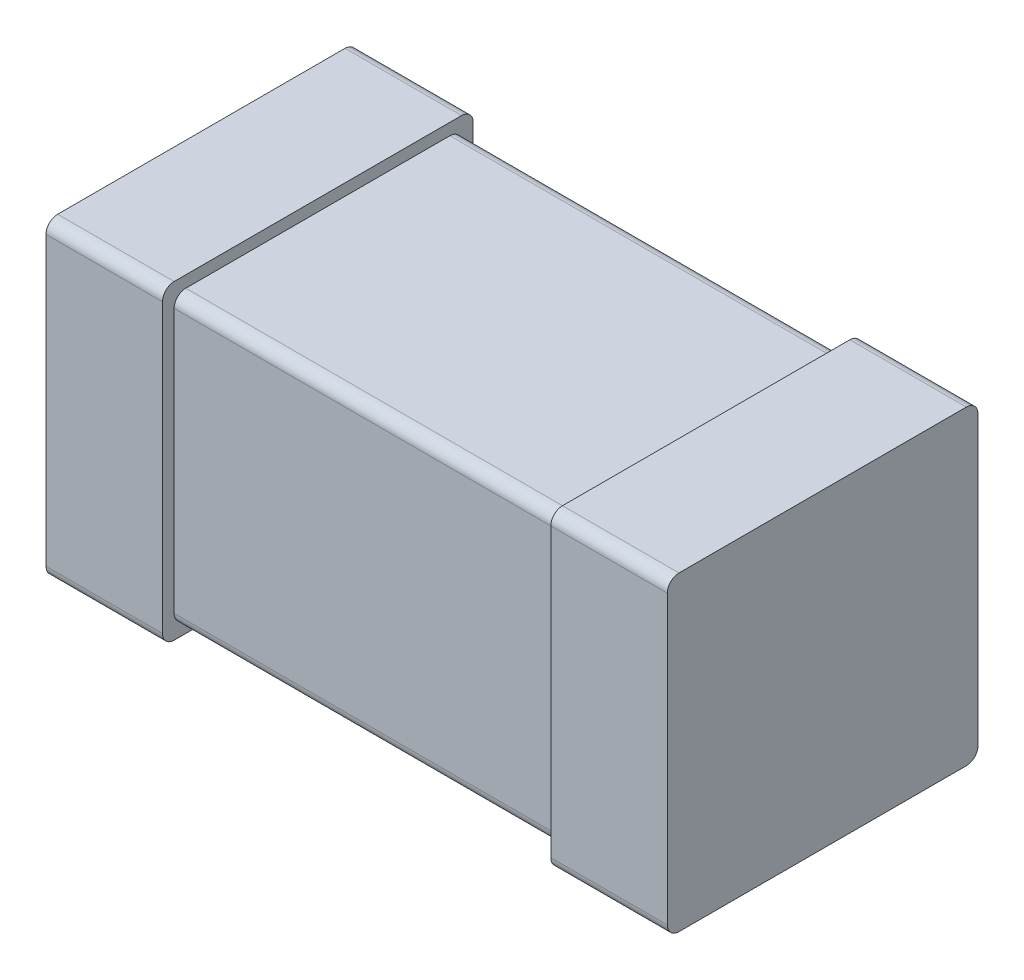
ISO-10303-21;
HEADER;
FILE_DESCRIPTION(('STEP AP214'),'2;1');
FILE_NAME('part.step','',(''),(''),'','','');
FILE_SCHEMA(('AUTOMOTIVE_DESIGN { 1 0 10303 214 1 1 1 1 }'));
ENDSEC;
DATA;
#1=APPLICATION_CONTEXT('core data for automotive mechanical design processes');
#2=APPLICATION_PROTOCOL_DEFINITION('international standard','automotive_design',2000,#1);
#3=PRODUCT_CONTEXT('',#1,'mechanical');
#4=PRODUCT('Part','Part','',(#3));
#5=PRODUCT_RELATED_PRODUCT_CATEGORY('part','',(#4));
#6=PRODUCT_DEFINITION_FORMATION('','',#4);
#7=PRODUCT_DEFINITION_CONTEXT('part definition',#1,'design');
#8=PRODUCT_DEFINITION('design','',#6,#7);
#9=PRODUCT_DEFINITION_SHAPE('','',#8);
#10=(LENGTH_UNIT() NAMED_UNIT(*) SI_UNIT(.MILLI.,.METRE.));
#11=(NAMED_UNIT(*) PLANE_ANGLE_UNIT() SI_UNIT($,.RADIAN.));
#12=(NAMED_UNIT(*) SI_UNIT($,.STERADIAN.) SOLID_ANGLE_UNIT());
#13=UNCERTAINTY_MEASURE_WITH_UNIT(LENGTH_MEASURE(1.E-05),#10,'distance_accuracy_value','');
#14=(GEOMETRIC_REPRESENTATION_CONTEXT(3) GLOBAL_UNCERTAINTY_ASSIGNED_CONTEXT((#13)) GLOBAL_UNIT_ASSIGNED_CONTEXT((#10,
#11,#12)) REPRESENTATION_CONTEXT('',''));
#15=CARTESIAN_POINT('',(0.,0.,0.));
#16=DIRECTION('',(0.,0.,1.));
#17=DIRECTION('',(1.,0.,0.));
#18=AXIS2_PLACEMENT_3D('',#15,#16,#17);
#19=CARTESIAN_POINT('',(0.8,-0.4,0.));
#20=DIRECTION('',(1.,0.,0.));
#21=DIRECTION('',(0.,1.,0.));
#22=AXIS2_PLACEMENT_3D('',#19,#20,#21);
#23=PLANE('',#22);
#24=DIRECTION('',(0.,0.,1.));
#25=VECTOR('',#24,1.);
#26=CARTESIAN_POINT('',(0.8,-0.4,0.));
#27=LINE('',#26,#25);
#28=CARTESIAN_POINT('',(0.8,-0.4,0.03));
#29=VERTEX_POINT('',#28);
#30=CARTESIAN_POINT('',(0.8,-0.4,0.77));
#31=VERTEX_POINT('',#30);
#32=EDGE_CURVE('E305',#29,#31,#27,.T.);
#33=ORIENTED_EDGE('',*,*,#32,.F.);
#34=CARTESIAN_POINT('',(0.8,-0.37,0.03));
#35=DIRECTION('',(1.,0.,0.));
#36=DIRECTION('',(0.,0.,1.));
#37=AXIS2_PLACEMENT_3D('',#34,#35,#36);
#38=CIRCLE('',#37,0.03);
#39=CARTESIAN_POINT('',(0.8,-0.37,0.));
#40=VERTEX_POINT('',#39);
#41=EDGE_CURVE('E304',#29,#40,#38,.T.);
#42=ORIENTED_EDGE('',*,*,#41,.T.);
#43=DIRECTION('',(0.,1.,0.));
#44=VECTOR('',#43,1.);
#45=CARTESIAN_POINT('',(0.8,-0.4,0.));
#46=LINE('',#45,#44);
#47=CARTESIAN_POINT('',(0.8,0.37,0.));
#48=VERTEX_POINT('',#47);
#49=EDGE_CURVE('E276',#40,#48,#46,.T.);
#50=ORIENTED_EDGE('',*,*,#49,.T.);
#51=CARTESIAN_POINT('',(0.8,0.37,0.03));
#52=DIRECTION('',(-1.,0.,0.));
#53=DIRECTION('',(0.,0.,1.));
#54=AXIS2_PLACEMENT_3D('',#51,#52,#53);
#55=CIRCLE('',#54,0.03);
#56=CARTESIAN_POINT('',(0.8,0.4,0.03));
#57=VERTEX_POINT('',#56);
#58=EDGE_CURVE('E506',#57,#48,#55,.T.);
#59=ORIENTED_EDGE('',*,*,#58,.F.);
#60=DIRECTION('',(0.,0.,1.));
#61=VECTOR('',#60,1.);
#62=CARTESIAN_POINT('',(0.8,0.4,0.));
#63=LINE('',#62,#61);
#64=CARTESIAN_POINT('',(0.8,0.4,0.77));
#65=VERTEX_POINT('',#64);
#66=EDGE_CURVE('E11',#57,#65,#63,.T.);
#67=ORIENTED_EDGE('',*,*,#66,.T.);
#68=CARTESIAN_POINT('',(0.8,0.37,0.77));
#69=DIRECTION('',(1.,0.,0.));
#70=DIRECTION('',(0.,0.,1.));
#71=AXIS2_PLACEMENT_3D('',#68,#69,#70);
#72=CIRCLE('',#71,0.03);
#73=CARTESIAN_POINT('',(0.8,0.37,0.8));
#74=VERTEX_POINT('',#73);
#75=EDGE_CURVE('E20',#65,#74,#72,.T.);
#76=ORIENTED_EDGE('',*,*,#75,.T.);
#77=DIRECTION('',(0.,1.,0.));
#78=VECTOR('',#77,1.);
#79=CARTESIAN_POINT('',(0.8,-0.4,0.8));
#80=LINE('',#79,#78);
#81=CARTESIAN_POINT('',(0.8,-0.37,0.8));
#82=VERTEX_POINT('',#81);
#83=EDGE_CURVE('E280',#82,#74,#80,.T.);
#84=ORIENTED_EDGE('',*,*,#83,.F.);
#85=CARTESIAN_POINT('',(0.8,-0.37,0.77));
#86=DIRECTION('',(-1.,0.,0.));
#87=DIRECTION('',(0.,0.,1.));
#88=AXIS2_PLACEMENT_3D('',#85,#86,#87);
#89=CIRCLE('',#88,0.03);
#90=EDGE_CURVE('E333',#31,#82,#89,.T.);
#91=ORIENTED_EDGE('',*,*,#90,.F.);
#92=EDGE_LOOP('',(#33,#42,#50,#59,#67,#76,#84,#91));
#93=FACE_BOUND('',#92,.T.);
#94=ADVANCED_FACE('F17',(#93),#23,.T.);
#95=CARTESIAN_POINT('',(0.5,0.4,0.));
#96=DIRECTION('',(0.,1.,0.));
#97=DIRECTION('',(1.,0.,0.));
#98=AXIS2_PLACEMENT_3D('',#95,#96,#97);
#99=PLANE('',#98);
#100=ORIENTED_EDGE('',*,*,#66,.F.);
#101=DIRECTION('',(1.,0.,0.));
#102=VECTOR('',#101,1.);
#103=CARTESIAN_POINT('',(0.5,0.4,0.03));
#104=LINE('',#103,#102);
#105=CARTESIAN_POINT('',(0.5,0.4,0.03));
#106=VERTEX_POINT('',#105);
#107=EDGE_CURVE('E503',#106,#57,#104,.T.);
#108=ORIENTED_EDGE('',*,*,#107,.F.);
#109=DIRECTION('',(0.,0.,1.));
#110=VECTOR('',#109,1.);
#111=CARTESIAN_POINT('',(0.5,0.4,0.));
#112=LINE('',#111,#110);
#113=CARTESIAN_POINT('',(0.5,0.4,0.77));
#114=VERTEX_POINT('',#113);
#115=EDGE_CURVE('E372',#106,#114,#112,.T.);
#116=ORIENTED_EDGE('',*,*,#115,.T.);
#117=DIRECTION('',(1.,0.,0.));
#118=VECTOR('',#117,1.);
#119=CARTESIAN_POINT('',(0.5,0.4,0.77));
#120=LINE('',#119,#118);
#121=EDGE_CURVE('E26',#114,#65,#120,.T.);
#122=ORIENTED_EDGE('',*,*,#121,.T.);
#123=EDGE_LOOP('',(#100,#108,#116,#122));
#124=FACE_BOUND('',#123,.T.);
#125=ADVANCED_FACE('F538',(#124),#99,.T.);
#126=CARTESIAN_POINT('',(0.5,0.37,0.77));
#127=DIRECTION('',(1.,0.,0.));
#128=DIRECTION('',(0.,1.,0.));
#129=AXIS2_PLACEMENT_3D('',#126,#127,#128);
#130=CYLINDRICAL_SURFACE('',#129,0.03);
#131=CARTESIAN_POINT('',(0.5,0.37,0.77));
#132=DIRECTION('',(1.,0.,0.));
#133=DIRECTION('',(0.,0.,1.));
#134=AXIS2_PLACEMENT_3D('',#131,#132,#133);
#135=CIRCLE('',#134,0.03);
#136=CARTESIAN_POINT('',(0.5,0.37,0.8));
#137=VERTEX_POINT('',#136);
#138=EDGE_CURVE('E377',#114,#137,#135,.T.);
#139=ORIENTED_EDGE('',*,*,#138,.T.);
#140=DIRECTION('',(1.,0.,0.));
#141=VECTOR('',#140,1.);
#142=CARTESIAN_POINT('',(0.5,0.37,0.8));
#143=LINE('',#142,#141);
#144=EDGE_CURVE('E497',#137,#74,#143,.T.);
#145=ORIENTED_EDGE('',*,*,#144,.T.);
#146=ORIENTED_EDGE('',*,*,#75,.F.);
#147=ORIENTED_EDGE('',*,*,#121,.F.);
#148=EDGE_LOOP('',(#139,#145,#146,#147));
#149=FACE_BOUND('',#148,.T.);
#150=ADVANCED_FACE('F516',(#149),#130,.T.);
#151=CARTESIAN_POINT('',(0.5,0.37,0.03));
#152=DIRECTION('',(1.,0.,0.));
#153=DIRECTION('',(0.,1.,0.));
#154=AXIS2_PLACEMENT_3D('',#151,#152,#153);
#155=CYLINDRICAL_SURFACE('',#154,0.03);
#156=ORIENTED_EDGE('',*,*,#107,.T.);
#157=ORIENTED_EDGE('',*,*,#58,.T.);
#158=DIRECTION('',(1.,0.,0.));
#159=VECTOR('',#158,1.);
#160=CARTESIAN_POINT('',(0.5,0.37,0.));
#161=LINE('',#160,#159);
#162=CARTESIAN_POINT('',(0.5,0.37,0.));
#163=VERTEX_POINT('',#162);
#164=EDGE_CURVE('E281',#163,#48,#161,.T.);
#165=ORIENTED_EDGE('',*,*,#164,.F.);
#166=CARTESIAN_POINT('',(0.5,0.37,0.03));
#167=DIRECTION('',(-1.,0.,0.));
#168=DIRECTION('',(0.,0.,1.));
#169=AXIS2_PLACEMENT_3D('',#166,#167,#168);
#170=CIRCLE('',#169,0.03);
#171=EDGE_CURVE('E376',#106,#163,#170,.T.);
#172=ORIENTED_EDGE('',*,*,#171,.F.);
#173=EDGE_LOOP('',(#156,#157,#165,#172));
#174=FACE_BOUND('',#173,.T.);
#175=ADVANCED_FACE('F534',(#174),#155,.T.);
#176=CARTESIAN_POINT('',(0.5,-0.4,0.8));
#177=DIRECTION('',(0.,0.,1.));
#178=DIRECTION('',(1.,0.,0.));
#179=AXIS2_PLACEMENT_3D('',#176,#177,#178);
#180=PLANE('',#179);
#181=DIRECTION('',(0.,1.,0.));
#182=VECTOR('',#181,1.);
#183=CARTESIAN_POINT('',(0.5,-0.4,0.8));
#184=LINE('',#183,#182);
#185=CARTESIAN_POINT('',(0.5,-0.37,0.8));
#186=VERTEX_POINT('',#185);
#187=EDGE_CURVE('E468',#186,#137,#184,.T.);
#188=ORIENTED_EDGE('',*,*,#187,.F.);
#189=DIRECTION('',(1.,0.,0.));
#190=VECTOR('',#189,1.);
#191=CARTESIAN_POINT('',(0.5,-0.37,0.8));
#192=LINE('',#191,#190);
#193=EDGE_CURVE('E393',#186,#82,#192,.T.);
#194=ORIENTED_EDGE('',*,*,#193,.T.);
#195=ORIENTED_EDGE('',*,*,#83,.T.);
#196=ORIENTED_EDGE('',*,*,#144,.F.);
#197=EDGE_LOOP('',(#188,#194,#195,#196));
#198=FACE_BOUND('',#197,.T.);
#199=ADVANCED_FACE('F520',(#198),#180,.T.);
#200=CARTESIAN_POINT('',(0.5,-0.4,0.));
#201=DIRECTION('',(0.,0.,1.));
#202=DIRECTION('',(1.,0.,0.));
#203=AXIS2_PLACEMENT_3D('',#200,#201,#202);
#204=PLANE('',#203);
#205=ORIENTED_EDGE('',*,*,#164,.T.);
#206=ORIENTED_EDGE('',*,*,#49,.F.);
#207=DIRECTION('',(1.,0.,0.));
#208=VECTOR('',#207,1.);
#209=CARTESIAN_POINT('',(0.5,-0.37,0.));
#210=LINE('',#209,#208);
#211=CARTESIAN_POINT('',(0.5,-0.37,0.));
#212=VERTEX_POINT('',#211);
#213=EDGE_CURVE('E300',#212,#40,#210,.T.);
#214=ORIENTED_EDGE('',*,*,#213,.F.);
#215=DIRECTION('',(0.,1.,0.));
#216=VECTOR('',#215,1.);
#217=CARTESIAN_POINT('',(0.5,-0.4,0.));
#218=LINE('',#217,#216);
#219=EDGE_CURVE('E478',#212,#163,#218,.T.);
#220=ORIENTED_EDGE('',*,*,#219,.T.);
#221=EDGE_LOOP('',(#205,#206,#214,#220));
#222=FACE_BOUND('',#221,.T.);
#223=ADVANCED_FACE('F532',(#222),#204,.F.);
#224=CARTESIAN_POINT('',(0.5,-0.37,0.77));
#225=DIRECTION('',(1.,0.,0.));
#226=DIRECTION('',(0.,-1.,0.));
#227=AXIS2_PLACEMENT_3D('',#224,#225,#226);
#228=CYLINDRICAL_SURFACE('',#227,0.03);
#229=DIRECTION('',(1.,0.,0.));
#230=VECTOR('',#229,1.);
#231=CARTESIAN_POINT('',(0.5,-0.4,0.77));
#232=LINE('',#231,#230);
#233=CARTESIAN_POINT('',(0.5,-0.4,0.77));
#234=VERTEX_POINT('',#233);
#235=EDGE_CURVE('E286',#234,#31,#232,.T.);
#236=ORIENTED_EDGE('',*,*,#235,.T.);
#237=ORIENTED_EDGE('',*,*,#90,.T.);
#238=ORIENTED_EDGE('',*,*,#193,.F.);
#239=CARTESIAN_POINT('',(0.5,-0.37,0.77));
#240=DIRECTION('',(-1.,0.,0.));
#241=DIRECTION('',(0.,0.,1.));
#242=AXIS2_PLACEMENT_3D('',#239,#240,#241);
#243=CIRCLE('',#242,0.03);
#244=EDGE_CURVE('E464',#234,#186,#243,.T.);
#245=ORIENTED_EDGE('',*,*,#244,.F.);
#246=EDGE_LOOP('',(#236,#237,#238,#245));
#247=FACE_BOUND('',#246,.T.);
#248=ADVANCED_FACE('F523',(#247),#228,.T.);
#249=CARTESIAN_POINT('',(0.5,-0.37,0.03));
#250=DIRECTION('',(1.,0.,0.));
#251=DIRECTION('',(0.,-1.,0.));
#252=AXIS2_PLACEMENT_3D('',#249,#250,#251);
#253=CYLINDRICAL_SURFACE('',#252,0.03);
#254=CARTESIAN_POINT('',(0.5,-0.37,0.03));
#255=DIRECTION('',(1.,0.,0.));
#256=DIRECTION('',(0.,0.,1.));
#257=AXIS2_PLACEMENT_3D('',#254,#255,#256);
#258=CIRCLE('',#257,0.03);
#259=CARTESIAN_POINT('',(0.5,-0.4,0.03));
#260=VERTEX_POINT('',#259);
#261=EDGE_CURVE('E287',#260,#212,#258,.T.);
#262=ORIENTED_EDGE('',*,*,#261,.T.);
#263=ORIENTED_EDGE('',*,*,#213,.T.);
#264=ORIENTED_EDGE('',*,*,#41,.F.);
#265=DIRECTION('',(1.,0.,0.));
#266=VECTOR('',#265,1.);
#267=CARTESIAN_POINT('',(0.5,-0.4,0.03));
#268=LINE('',#267,#266);
#269=EDGE_CURVE('E445',#260,#29,#268,.T.);
#270=ORIENTED_EDGE('',*,*,#269,.F.);
#271=EDGE_LOOP('',(#262,#263,#264,#270));
#272=FACE_BOUND('',#271,.T.);
#273=ADVANCED_FACE('F529',(#272),#253,.T.);
#274=CARTESIAN_POINT('',(0.5,-0.4,0.));
#275=DIRECTION('',(0.,1.,0.));
#276=DIRECTION('',(1.,0.,0.));
#277=AXIS2_PLACEMENT_3D('',#274,#275,#276);
#278=PLANE('',#277);
#279=ORIENTED_EDGE('',*,*,#235,.F.);
#280=DIRECTION('',(0.,0.,1.));
#281=VECTOR('',#280,1.);
#282=CARTESIAN_POINT('',(0.5,-0.4,0.));
#283=LINE('',#282,#281);
#284=EDGE_CURVE('E282',#260,#234,#283,.T.);
#285=ORIENTED_EDGE('',*,*,#284,.F.);
#286=ORIENTED_EDGE('',*,*,#269,.T.);
#287=ORIENTED_EDGE('',*,*,#32,.T.);
#288=EDGE_LOOP('',(#279,#285,#286,#287));
#289=FACE_BOUND('',#288,.T.);
#290=ADVANCED_FACE('F525',(#289),#278,.F.);
#291=CARTESIAN_POINT('',(0.5,-0.4,0.));
#292=DIRECTION('',(1.,0.,0.));
#293=DIRECTION('',(0.,1.,0.));
#294=AXIS2_PLACEMENT_3D('',#291,#292,#293);
#295=PLANE('',#294);
#296=DIRECTION('',(0.,1.,0.));
#297=VECTOR('',#296,1.);
#298=CARTESIAN_POINT('',(0.5,-0.37,0.03));
#299=LINE('',#298,#297);
#300=CARTESIAN_POINT('',(0.5,-0.34,0.03));
#301=VERTEX_POINT('',#300);
#302=CARTESIAN_POINT('',(0.5,0.34,0.03));
#303=VERTEX_POINT('',#302);
#304=EDGE_CURVE('E310',#301,#303,#299,.T.);
#305=ORIENTED_EDGE('',*,*,#304,.T.);
#306=CARTESIAN_POINT('',(0.5,0.34,0.06));
#307=DIRECTION('',(-1.,0.,0.));
#308=DIRECTION('',(0.,0.,1.));
#309=AXIS2_PLACEMENT_3D('',#306,#307,#308);
#310=CIRCLE('',#309,0.03);
#311=CARTESIAN_POINT('',(0.5,0.37,0.06));
#312=VERTEX_POINT('',#311);
#313=EDGE_CURVE('E407',#312,#303,#310,.T.);
#314=ORIENTED_EDGE('',*,*,#313,.F.);
#315=DIRECTION('',(0.,0.,1.));
#316=VECTOR('',#315,1.);
#317=CARTESIAN_POINT('',(0.5,0.37,0.03));
#318=LINE('',#317,#316);
#319=CARTESIAN_POINT('',(0.5,0.37,0.74));
#320=VERTEX_POINT('',#319);
#321=EDGE_CURVE('E402',#312,#320,#318,.T.);
#322=ORIENTED_EDGE('',*,*,#321,.T.);
#323=CARTESIAN_POINT('',(0.5,0.34,0.74));
#324=DIRECTION('',(1.,0.,0.));
#325=DIRECTION('',(0.,0.,1.));
#326=AXIS2_PLACEMENT_3D('',#323,#324,#325);
#327=CIRCLE('',#326,0.03);
#328=CARTESIAN_POINT('',(0.5,0.34,0.77));
#329=VERTEX_POINT('',#328);
#330=EDGE_CURVE('E353',#320,#329,#327,.T.);
#331=ORIENTED_EDGE('',*,*,#330,.T.);
#332=DIRECTION('',(0.,1.,0.));
#333=VECTOR('',#332,1.);
#334=CARTESIAN_POINT('',(0.5,-0.37,0.77));
#335=LINE('',#334,#333);
#336=CARTESIAN_POINT('',(0.5,-0.34,0.77));
#337=VERTEX_POINT('',#336);
#338=EDGE_CURVE('E352',#337,#329,#335,.T.);
#339=ORIENTED_EDGE('',*,*,#338,.F.);
#340=CARTESIAN_POINT('',(0.5,-0.34,0.74));
#341=DIRECTION('',(-1.,0.,0.));
#342=DIRECTION('',(0.,0.,1.));
#343=AXIS2_PLACEMENT_3D('',#340,#341,#342);
#344=CIRCLE('',#343,0.03);
#345=CARTESIAN_POINT('',(0.5,-0.37,0.74));
#346=VERTEX_POINT('',#345);
#347=EDGE_CURVE('E458',#346,#337,#344,.T.);
#348=ORIENTED_EDGE('',*,*,#347,.F.);
#349=DIRECTION('',(0.,0.,1.));
#350=VECTOR('',#349,1.);
#351=CARTESIAN_POINT('',(0.5,-0.37,0.03));
#352=LINE('',#351,#350);
#353=CARTESIAN_POINT('',(0.5,-0.37,0.06));
#354=VERTEX_POINT('',#353);
#355=EDGE_CURVE('E461',#354,#346,#352,.T.);
#356=ORIENTED_EDGE('',*,*,#355,.F.);
#357=CARTESIAN_POINT('',(0.5,-0.34,0.06));
#358=DIRECTION('',(1.,0.,0.));
#359=DIRECTION('',(0.,0.,1.));
#360=AXIS2_PLACEMENT_3D('',#357,#358,#359);
#361=CIRCLE('',#360,0.03);
#362=EDGE_CURVE('E322',#354,#301,#361,.T.);
#363=ORIENTED_EDGE('',*,*,#362,.T.);
#364=EDGE_LOOP('',(#305,#314,#322,#331,#339,#348,#356,#363));
#365=FACE_BOUND('',#364,.T.);
#366=ORIENTED_EDGE('',*,*,#244,.T.);
#367=ORIENTED_EDGE('',*,*,#187,.T.);
#368=ORIENTED_EDGE('',*,*,#138,.F.);
#369=ORIENTED_EDGE('',*,*,#115,.F.);
#370=ORIENTED_EDGE('',*,*,#171,.T.);
#371=ORIENTED_EDGE('',*,*,#219,.F.);
#372=ORIENTED_EDGE('',*,*,#261,.F.);
#373=ORIENTED_EDGE('',*,*,#284,.T.);
#374=EDGE_LOOP('',(#366,#367,#368,#369,#370,#371,#372,#373));
#375=FACE_BOUND('',#374,.T.);
#376=ADVANCED_FACE('F537',(#365,#375),#295,.F.);
#377=CARTESIAN_POINT('',(-0.5,-0.37,0.03));
#378=DIRECTION('',(0.,1.,0.));
#379=DIRECTION('',(1.,0.,0.));
#380=AXIS2_PLACEMENT_3D('',#377,#378,#379);
#381=PLANE('',#380);
#382=DIRECTION('',(1.,0.,0.));
#383=VECTOR('',#382,1.);
#384=CARTESIAN_POINT('',(-0.5,-0.37,0.74));
#385=LINE('',#384,#383);
#386=CARTESIAN_POINT('',(-0.5,-0.37,0.74));
#387=VERTEX_POINT('',#386);
#388=EDGE_CURVE('E454',#387,#346,#385,.T.);
#389=ORIENTED_EDGE('',*,*,#388,.F.);
#390=DIRECTION('',(0.,0.,1.));
#391=VECTOR('',#390,1.);
#392=CARTESIAN_POINT('',(-0.5,-0.37,0.03));
#393=LINE('',#392,#391);
#394=CARTESIAN_POINT('',(-0.5,-0.37,0.06));
#395=VERTEX_POINT('',#394);
#396=EDGE_CURVE('E381',#395,#387,#393,.T.);
#397=ORIENTED_EDGE('',*,*,#396,.F.);
#398=DIRECTION('',(1.,0.,0.));
#399=VECTOR('',#398,1.);
#400=CARTESIAN_POINT('',(-0.5,-0.37,0.06));
#401=LINE('',#400,#399);
#402=EDGE_CURVE('E311',#395,#354,#401,.T.);
#403=ORIENTED_EDGE('',*,*,#402,.T.);
#404=ORIENTED_EDGE('',*,*,#355,.T.);
#405=EDGE_LOOP('',(#389,#397,#403,#404));
#406=FACE_BOUND('',#405,.T.);
#407=ADVANCED_FACE('F559',(#406),#381,.F.);
#408=CARTESIAN_POINT('',(-0.5,-0.34,0.74));
#409=DIRECTION('',(1.,0.,0.));
#410=DIRECTION('',(0.,-1.,0.));
#411=AXIS2_PLACEMENT_3D('',#408,#409,#410);
#412=CYLINDRICAL_SURFACE('',#411,0.03);
#413=ORIENTED_EDGE('',*,*,#388,.T.);
#414=ORIENTED_EDGE('',*,*,#347,.T.);
#415=DIRECTION('',(1.,0.,0.));
#416=VECTOR('',#415,1.);
#417=CARTESIAN_POINT('',(-0.5,-0.34,0.77));
#418=LINE('',#417,#416);
#419=CARTESIAN_POINT('',(-0.5,-0.34,0.77));
#420=VERTEX_POINT('',#419);
#421=EDGE_CURVE('E348',#420,#337,#418,.T.);
#422=ORIENTED_EDGE('',*,*,#421,.F.);
#423=CARTESIAN_POINT('',(-0.5,-0.34,0.74));
#424=DIRECTION('',(-1.,0.,0.));
#425=DIRECTION('',(0.,0.,1.));
#426=AXIS2_PLACEMENT_3D('',#423,#424,#425);
#427=CIRCLE('',#426,0.03);
#428=EDGE_CURVE('E385',#387,#420,#427,.T.);
#429=ORIENTED_EDGE('',*,*,#428,.F.);
#430=EDGE_LOOP('',(#413,#414,#422,#429));
#431=FACE_BOUND('',#430,.T.);
#432=ADVANCED_FACE('F562',(#431),#412,.T.);
#433=CARTESIAN_POINT('',(-0.5,-0.37,0.77));
#434=DIRECTION('',(0.,0.,1.));
#435=DIRECTION('',(1.,0.,0.));
#436=AXIS2_PLACEMENT_3D('',#433,#434,#435);
#437=PLANE('',#436);
#438=DIRECTION('',(0.,1.,0.));
#439=VECTOR('',#438,1.);
#440=CARTESIAN_POINT('',(-0.5,-0.37,0.77));
#441=LINE('',#440,#439);
#442=CARTESIAN_POINT('',(-0.5,0.34,0.77));
#443=VERTEX_POINT('',#442);
#444=EDGE_CURVE('E389',#420,#443,#441,.T.);
#445=ORIENTED_EDGE('',*,*,#444,.F.);
#446=ORIENTED_EDGE('',*,*,#421,.T.);
#447=ORIENTED_EDGE('',*,*,#338,.T.);
#448=DIRECTION('',(1.,0.,0.));
#449=VECTOR('',#448,1.);
#450=CARTESIAN_POINT('',(-0.5,0.34,0.77));
#451=LINE('',#450,#449);
#452=EDGE_CURVE('E441',#443,#329,#451,.T.);
#453=ORIENTED_EDGE('',*,*,#452,.F.);
#454=EDGE_LOOP('',(#445,#446,#447,#453));
#455=FACE_BOUND('',#454,.T.);
#456=ADVANCED_FACE('F566',(#455),#437,.T.);
#457=CARTESIAN_POINT('',(-0.5,0.34,0.74));
#458=DIRECTION('',(1.,0.,0.));
#459=DIRECTION('',(0.,1.,0.));
#460=AXIS2_PLACEMENT_3D('',#457,#458,#459);
#461=CYLINDRICAL_SURFACE('',#460,0.03);
#462=CARTESIAN_POINT('',(-0.5,0.34,0.74));
#463=DIRECTION('',(1.,0.,0.));
#464=DIRECTION('',(0.,0.,1.));
#465=AXIS2_PLACEMENT_3D('',#462,#463,#464);
#466=CIRCLE('',#465,0.03);
#467=CARTESIAN_POINT('',(-0.5,0.37,0.74));
#468=VERTEX_POINT('',#467);
#469=EDGE_CURVE('E397',#468,#443,#466,.T.);
#470=ORIENTED_EDGE('',*,*,#469,.T.);
#471=ORIENTED_EDGE('',*,*,#452,.T.);
#472=ORIENTED_EDGE('',*,*,#330,.F.);
#473=DIRECTION('',(1.,0.,0.));
#474=VECTOR('',#473,1.);
#475=CARTESIAN_POINT('',(-0.5,0.37,0.74));
#476=LINE('',#475,#474);
#477=EDGE_CURVE('E406',#468,#320,#476,.T.);
#478=ORIENTED_EDGE('',*,*,#477,.F.);
#479=EDGE_LOOP('',(#470,#471,#472,#478));
#480=FACE_BOUND('',#479,.T.);
#481=ADVANCED_FACE('F574',(#480),#461,.T.);
#482=CARTESIAN_POINT('',(-0.5,0.37,0.03));
#483=DIRECTION('',(0.,1.,0.));
#484=DIRECTION('',(1.,0.,0.));
#485=AXIS2_PLACEMENT_3D('',#482,#483,#484);
#486=PLANE('',#485);
#487=ORIENTED_EDGE('',*,*,#321,.F.);
#488=DIRECTION('',(1.,0.,0.));
#489=VECTOR('',#488,1.);
#490=CARTESIAN_POINT('',(-0.5,0.37,0.06));
#491=LINE('',#490,#489);
#492=CARTESIAN_POINT('',(-0.5,0.37,0.06));
#493=VERTEX_POINT('',#492);
#494=EDGE_CURVE('E432',#493,#312,#491,.T.);
#495=ORIENTED_EDGE('',*,*,#494,.F.);
#496=DIRECTION('',(0.,0.,1.));
#497=VECTOR('',#496,1.);
#498=CARTESIAN_POINT('',(-0.5,0.37,0.03));
#499=LINE('',#498,#497);
#500=EDGE_CURVE('E401',#493,#468,#499,.T.);
#501=ORIENTED_EDGE('',*,*,#500,.T.);
#502=ORIENTED_EDGE('',*,*,#477,.T.);
#503=EDGE_LOOP('',(#487,#495,#501,#502));
#504=FACE_BOUND('',#503,.T.);
#505=ADVANCED_FACE('F572',(#504),#486,.T.);
#506=CARTESIAN_POINT('',(-0.5,0.34,0.06));
#507=DIRECTION('',(1.,0.,0.));
#508=DIRECTION('',(0.,1.,0.));
#509=AXIS2_PLACEMENT_3D('',#506,#507,#508);
#510=CYLINDRICAL_SURFACE('',#509,0.03);
#511=ORIENTED_EDGE('',*,*,#494,.T.);
#512=ORIENTED_EDGE('',*,*,#313,.T.);
#513=DIRECTION('',(1.,0.,0.));
#514=VECTOR('',#513,1.);
#515=CARTESIAN_POINT('',(-0.5,0.34,0.03));
#516=LINE('',#515,#514);
#517=CARTESIAN_POINT('',(-0.5,0.34,0.03));
#518=VERTEX_POINT('',#517);
#519=EDGE_CURVE('E306',#518,#303,#516,.T.);
#520=ORIENTED_EDGE('',*,*,#519,.F.);
#521=CARTESIAN_POINT('',(-0.5,0.34,0.06));
#522=DIRECTION('',(-1.,0.,0.));
#523=DIRECTION('',(0.,0.,1.));
#524=AXIS2_PLACEMENT_3D('',#521,#522,#523);
#525=CIRCLE('',#524,0.03);
#526=EDGE_CURVE('E411',#493,#518,#525,.T.);
#527=ORIENTED_EDGE('',*,*,#526,.F.);
#528=EDGE_LOOP('',(#511,#512,#520,#527));
#529=FACE_BOUND('',#528,.T.);
#530=ADVANCED_FACE('F568',(#529),#510,.T.);
#531=CARTESIAN_POINT('',(-0.5,-0.37,0.03));
#532=DIRECTION('',(0.,0.,1.));
#533=DIRECTION('',(1.,0.,0.));
#534=AXIS2_PLACEMENT_3D('',#531,#532,#533);
#535=PLANE('',#534);
#536=ORIENTED_EDGE('',*,*,#519,.T.);
#537=ORIENTED_EDGE('',*,*,#304,.F.);
#538=DIRECTION('',(1.,0.,0.));
#539=VECTOR('',#538,1.);
#540=CARTESIAN_POINT('',(-0.5,-0.34,0.03));
#541=LINE('',#540,#539);
#542=CARTESIAN_POINT('',(-0.5,-0.34,0.03));
#543=VERTEX_POINT('',#542);
#544=EDGE_CURVE('E422',#543,#301,#541,.T.);
#545=ORIENTED_EDGE('',*,*,#544,.F.);
#546=DIRECTION('',(0.,1.,0.));
#547=VECTOR('',#546,1.);
#548=CARTESIAN_POINT('',(-0.5,-0.37,0.03));
#549=LINE('',#548,#547);
#550=EDGE_CURVE('E415',#543,#518,#549,.T.);
#551=ORIENTED_EDGE('',*,*,#550,.T.);
#552=EDGE_LOOP('',(#536,#537,#545,#551));
#553=FACE_BOUND('',#552,.T.);
#554=ADVANCED_FACE('F571',(#553),#535,.F.);
#555=CARTESIAN_POINT('',(-0.5,-0.34,0.06));
#556=DIRECTION('',(1.,0.,0.));
#557=DIRECTION('',(0.,-1.,0.));
#558=AXIS2_PLACEMENT_3D('',#555,#556,#557);
#559=CYLINDRICAL_SURFACE('',#558,0.03);
#560=CARTESIAN_POINT('',(-0.5,-0.34,0.06));
#561=DIRECTION('',(1.,0.,0.));
#562=DIRECTION('',(0.,0.,1.));
#563=AXIS2_PLACEMENT_3D('',#560,#561,#562);
#564=CIRCLE('',#563,0.03);
#565=EDGE_CURVE('E290',#395,#543,#564,.T.);
#566=ORIENTED_EDGE('',*,*,#565,.T.);
#567=ORIENTED_EDGE('',*,*,#544,.T.);
#568=ORIENTED_EDGE('',*,*,#362,.F.);
#569=ORIENTED_EDGE('',*,*,#402,.F.);
#570=EDGE_LOOP('',(#566,#567,#568,#569));
#571=FACE_BOUND('',#570,.T.);
#572=ADVANCED_FACE('F582',(#571),#559,.T.);
#573=CARTESIAN_POINT('',(-0.5,-0.4,0.));
#574=DIRECTION('',(1.,0.,0.));
#575=DIRECTION('',(0.,1.,0.));
#576=AXIS2_PLACEMENT_3D('',#573,#574,#575);
#577=PLANE('',#576);
#578=ORIENTED_EDGE('',*,*,#565,.F.);
#579=ORIENTED_EDGE('',*,*,#396,.T.);
#580=ORIENTED_EDGE('',*,*,#428,.T.);
#581=ORIENTED_EDGE('',*,*,#444,.T.);
#582=ORIENTED_EDGE('',*,*,#469,.F.);
#583=ORIENTED_EDGE('',*,*,#500,.F.);
#584=ORIENTED_EDGE('',*,*,#526,.T.);
#585=ORIENTED_EDGE('',*,*,#550,.F.);
#586=EDGE_LOOP('',(#578,#579,#580,#581,#582,#583,#584,#585));
#587=FACE_BOUND('',#586,.T.);
#588=DIRECTION('',(0.,0.,1.));
#589=VECTOR('',#588,1.);
#590=CARTESIAN_POINT('',(-0.5,-0.4,0.));
#591=LINE('',#590,#589);
#592=CARTESIAN_POINT('',(-0.5,-0.4,0.03));
#593=VERTEX_POINT('',#592);
#594=CARTESIAN_POINT('',(-0.5,-0.4,0.77));
#595=VERTEX_POINT('',#594);
#596=EDGE_CURVE('E237',#593,#595,#591,.T.);
#597=ORIENTED_EDGE('',*,*,#596,.F.);
#598=CARTESIAN_POINT('',(-0.5,-0.37,0.03));
#599=DIRECTION('',(1.,0.,0.));
#600=DIRECTION('',(0.,0.,1.));
#601=AXIS2_PLACEMENT_3D('',#598,#599,#600);
#602=CIRCLE('',#601,0.03);
#603=CARTESIAN_POINT('',(-0.5,-0.37,0.));
#604=VERTEX_POINT('',#603);
#605=EDGE_CURVE('E318',#593,#604,#602,.T.);
#606=ORIENTED_EDGE('',*,*,#605,.T.);
#607=DIRECTION('',(0.,1.,0.));
#608=VECTOR('',#607,1.);
#609=CARTESIAN_POINT('',(-0.5,-0.4,0.));
#610=LINE('',#609,#608);
#611=CARTESIAN_POINT('',(-0.5,0.37,0.));
#612=VERTEX_POINT('',#611);
#613=EDGE_CURVE('E357',#604,#612,#610,.T.);
#614=ORIENTED_EDGE('',*,*,#613,.T.);
#615=CARTESIAN_POINT('',(-0.5,0.37,0.03));
#616=DIRECTION('',(-1.,0.,0.));
#617=DIRECTION('',(0.,0.,1.));
#618=AXIS2_PLACEMENT_3D('',#615,#616,#617);
#619=CIRCLE('',#618,0.03);
#620=CARTESIAN_POINT('',(-0.5,0.4,0.03));
#621=VERTEX_POINT('',#620);
#622=EDGE_CURVE('E270',#621,#612,#619,.T.);
#623=ORIENTED_EDGE('',*,*,#622,.F.);
#624=DIRECTION('',(0.,0.,1.));
#625=VECTOR('',#624,1.);
#626=CARTESIAN_POINT('',(-0.5,0.4,0.));
#627=LINE('',#626,#625);
#628=CARTESIAN_POINT('',(-0.5,0.4,0.77));
#629=VERTEX_POINT('',#628);
#630=EDGE_CURVE('E288',#621,#629,#627,.T.);
#631=ORIENTED_EDGE('',*,*,#630,.T.);
#632=CARTESIAN_POINT('',(-0.5,0.37,0.77));
#633=DIRECTION('',(1.,0.,0.));
#634=DIRECTION('',(0.,0.,1.));
#635=AXIS2_PLACEMENT_3D('',#632,#633,#634);
#636=CIRCLE('',#635,0.03);
#637=CARTESIAN_POINT('',(-0.5,0.37,0.8));
#638=VERTEX_POINT('',#637);
#639=EDGE_CURVE('E366',#629,#638,#636,.T.);
#640=ORIENTED_EDGE('',*,*,#639,.T.);
#641=DIRECTION('',(0.,1.,0.));
#642=VECTOR('',#641,1.);
#643=CARTESIAN_POINT('',(-0.5,-0.4,0.8));
#644=LINE('',#643,#642);
#645=CARTESIAN_POINT('',(-0.5,-0.37,0.8));
#646=VERTEX_POINT('',#645);
#647=EDGE_CURVE('E337',#646,#638,#644,.T.);
#648=ORIENTED_EDGE('',*,*,#647,.F.);
#649=CARTESIAN_POINT('',(-0.5,-0.37,0.77));
#650=DIRECTION('',(-1.,0.,0.));
#651=DIRECTION('',(0.,0.,1.));
#652=AXIS2_PLACEMENT_3D('',#649,#650,#651);
#653=CIRCLE('',#652,0.03);
#654=EDGE_CURVE('E275',#595,#646,#653,.T.);
#655=ORIENTED_EDGE('',*,*,#654,.F.);
#656=EDGE_LOOP('',(#597,#606,#614,#623,#631,#640,#648,#655));
#657=FACE_BOUND('',#656,.T.);
#658=ADVANCED_FACE('F578',(#587,#657),#577,.T.);
#659=CARTESIAN_POINT('',(-0.8,0.4,0.));
#660=DIRECTION('',(0.,1.,0.));
#661=DIRECTION('',(1.,0.,0.));
#662=AXIS2_PLACEMENT_3D('',#659,#660,#661);
#663=PLANE('',#662);
#664=ORIENTED_EDGE('',*,*,#630,.F.);
#665=DIRECTION('',(1.,0.,0.));
#666=VECTOR('',#665,1.);
#667=CARTESIAN_POINT('',(-0.8,0.4,0.03));
#668=LINE('',#667,#666);
#669=CARTESIAN_POINT('',(-0.8,0.4,0.03));
#670=VERTEX_POINT('',#669);
#671=EDGE_CURVE('E267',#670,#621,#668,.T.);
#672=ORIENTED_EDGE('',*,*,#671,.F.);
#673=DIRECTION('',(0.,0.,1.));
#674=VECTOR('',#673,1.);
#675=CARTESIAN_POINT('',(-0.8,0.4,0.));
#676=LINE('',#675,#674);
#677=CARTESIAN_POINT('',(-0.8,0.4,0.77));
#678=VERTEX_POINT('',#677);
#679=EDGE_CURVE('E299',#670,#678,#676,.T.);
#680=ORIENTED_EDGE('',*,*,#679,.T.);
#681=DIRECTION('',(1.,0.,0.));
#682=VECTOR('',#681,1.);
#683=CARTESIAN_POINT('',(-0.8,0.4,0.77));
#684=LINE('',#683,#682);
#685=EDGE_CURVE('E291',#678,#629,#684,.T.);
#686=ORIENTED_EDGE('',*,*,#685,.T.);
#687=EDGE_LOOP('',(#664,#672,#680,#686));
#688=FACE_BOUND('',#687,.T.);
#689=ADVANCED_FACE('F581',(#688),#663,.T.);
#690=CARTESIAN_POINT('',(-0.8,0.37,0.77));
#691=DIRECTION('',(1.,0.,0.));
#692=DIRECTION('',(0.,1.,0.));
#693=AXIS2_PLACEMENT_3D('',#690,#691,#692);
#694=CYLINDRICAL_SURFACE('',#693,0.03);
#695=CARTESIAN_POINT('',(-0.8,0.37,0.77));
#696=DIRECTION('',(1.,0.,0.));
#697=DIRECTION('',(0.,0.,1.));
#698=AXIS2_PLACEMENT_3D('',#695,#696,#697);
#699=CIRCLE('',#698,0.03);
#700=CARTESIAN_POINT('',(-0.8,0.37,0.8));
#701=VERTEX_POINT('',#700);
#702=EDGE_CURVE('E264',#678,#701,#699,.T.);
#703=ORIENTED_EDGE('',*,*,#702,.T.);
#704=DIRECTION('',(1.,0.,0.));
#705=VECTOR('',#704,1.);
#706=CARTESIAN_POINT('',(-0.8,0.37,0.8));
#707=LINE('',#706,#705);
#708=EDGE_CURVE('E271',#701,#638,#707,.T.);
#709=ORIENTED_EDGE('',*,*,#708,.T.);
#710=ORIENTED_EDGE('',*,*,#639,.F.);
#711=ORIENTED_EDGE('',*,*,#685,.F.);
#712=EDGE_LOOP('',(#703,#709,#710,#711));
#713=FACE_BOUND('',#712,.T.);
#714=ADVANCED_FACE('F586',(#713),#694,.T.);
#715=CARTESIAN_POINT('',(-0.8,0.37,0.03));
#716=DIRECTION('',(1.,0.,0.));
#717=DIRECTION('',(0.,1.,0.));
#718=AXIS2_PLACEMENT_3D('',#715,#716,#717);
#719=CYLINDRICAL_SURFACE('',#718,0.03);
#720=ORIENTED_EDGE('',*,*,#671,.T.);
#721=ORIENTED_EDGE('',*,*,#622,.T.);
#722=DIRECTION('',(1.,0.,0.));
#723=VECTOR('',#722,1.);
#724=CARTESIAN_POINT('',(-0.8,0.37,0.));
#725=LINE('',#724,#723);
#726=CARTESIAN_POINT('',(-0.8,0.37,0.));
#727=VERTEX_POINT('',#726);
#728=EDGE_CURVE('E274',#727,#612,#725,.T.);
#729=ORIENTED_EDGE('',*,*,#728,.F.);
#730=CARTESIAN_POINT('',(-0.8,0.37,0.03));
#731=DIRECTION('',(-1.,0.,0.));
#732=DIRECTION('',(0.,0.,1.));
#733=AXIS2_PLACEMENT_3D('',#730,#731,#732);
#734=CIRCLE('',#733,0.03);
#735=EDGE_CURVE('E315',#670,#727,#734,.T.);
#736=ORIENTED_EDGE('',*,*,#735,.F.);
#737=EDGE_LOOP('',(#720,#721,#729,#736));
#738=FACE_BOUND('',#737,.T.);
#739=ADVANCED_FACE('F595',(#738),#719,.T.);
#740=CARTESIAN_POINT('',(-0.8,-0.4,0.8));
#741=DIRECTION('',(0.,0.,1.));
#742=DIRECTION('',(1.,0.,0.));
#743=AXIS2_PLACEMENT_3D('',#740,#741,#742);
#744=PLANE('',#743);
#745=DIRECTION('',(0.,1.,0.));
#746=VECTOR('',#745,1.);
#747=CARTESIAN_POINT('',(-0.8,-0.4,0.8));
#748=LINE('',#747,#746);
#749=CARTESIAN_POINT('',(-0.8,-0.37,0.8));
#750=VERTEX_POINT('',#749);
#751=EDGE_CURVE('E259',#750,#701,#748,.T.);
#752=ORIENTED_EDGE('',*,*,#751,.F.);
#753=DIRECTION('',(1.,0.,0.));
#754=VECTOR('',#753,1.);
#755=CARTESIAN_POINT('',(-0.8,-0.37,0.8));
#756=LINE('',#755,#754);
#757=EDGE_CURVE('E256',#750,#646,#756,.T.);
#758=ORIENTED_EDGE('',*,*,#757,.T.);
#759=ORIENTED_EDGE('',*,*,#647,.T.);
#760=ORIENTED_EDGE('',*,*,#708,.F.);
#761=EDGE_LOOP('',(#752,#758,#759,#760));
#762=FACE_BOUND('',#761,.T.);
#763=ADVANCED_FACE('F591',(#762),#744,.T.);
#764=CARTESIAN_POINT('',(-0.8,-0.4,0.));
#765=DIRECTION('',(0.,0.,1.));
#766=DIRECTION('',(1.,0.,0.));
#767=AXIS2_PLACEMENT_3D('',#764,#765,#766);
#768=PLANE('',#767);
#769=ORIENTED_EDGE('',*,*,#728,.T.);
#770=ORIENTED_EDGE('',*,*,#613,.F.);
#771=DIRECTION('',(1.,0.,0.));
#772=VECTOR('',#771,1.);
#773=CARTESIAN_POINT('',(-0.8,-0.37,0.));
#774=LINE('',#773,#772);
#775=CARTESIAN_POINT('',(-0.8,-0.37,0.));
#776=VERTEX_POINT('',#775);
#777=EDGE_CURVE('E295',#776,#604,#774,.T.);
#778=ORIENTED_EDGE('',*,*,#777,.F.);
#779=DIRECTION('',(0.,1.,0.));
#780=VECTOR('',#779,1.);
#781=CARTESIAN_POINT('',(-0.8,-0.4,0.));
#782=LINE('',#781,#780);
#783=EDGE_CURVE('E326',#776,#727,#782,.T.);
#784=ORIENTED_EDGE('',*,*,#783,.T.);
#785=EDGE_LOOP('',(#769,#770,#778,#784));
#786=FACE_BOUND('',#785,.T.);
#787=ADVANCED_FACE('F594',(#786),#768,.F.);
#788=CARTESIAN_POINT('',(-0.8,-0.37,0.77));
#789=DIRECTION('',(1.,0.,0.));
#790=DIRECTION('',(0.,-1.,0.));
#791=AXIS2_PLACEMENT_3D('',#788,#789,#790);
#792=CYLINDRICAL_SURFACE('',#791,0.03);
#793=DIRECTION('',(1.,0.,0.));
#794=VECTOR('',#793,1.);
#795=CARTESIAN_POINT('',(-0.8,-0.4,0.77));
#796=LINE('',#795,#794);
#797=CARTESIAN_POINT('',(-0.8,-0.4,0.77));
#798=VERTEX_POINT('',#797);
#799=EDGE_CURVE('E230',#798,#595,#796,.T.);
#800=ORIENTED_EDGE('',*,*,#799,.T.);
#801=ORIENTED_EDGE('',*,*,#654,.T.);
#802=ORIENTED_EDGE('',*,*,#757,.F.);
#803=CARTESIAN_POINT('',(-0.8,-0.37,0.77));
#804=DIRECTION('',(-1.,0.,0.));
#805=DIRECTION('',(0.,0.,1.));
#806=AXIS2_PLACEMENT_3D('',#803,#804,#805);
#807=CIRCLE('',#806,0.03);
#808=EDGE_CURVE('E248',#798,#750,#807,.T.);
#809=ORIENTED_EDGE('',*,*,#808,.F.);
#810=EDGE_LOOP('',(#800,#801,#802,#809));
#811=FACE_BOUND('',#810,.T.);
#812=ADVANCED_FACE('F254',(#811),#792,.T.);
#813=CARTESIAN_POINT('',(-0.8,-0.37,0.03));
#814=DIRECTION('',(1.,0.,0.));
#815=DIRECTION('',(0.,-1.,0.));
#816=AXIS2_PLACEMENT_3D('',#813,#814,#815);
#817=CYLINDRICAL_SURFACE('',#816,0.03);
#818=CARTESIAN_POINT('',(-0.8,-0.37,0.03));
#819=DIRECTION('',(1.,0.,0.));
#820=DIRECTION('',(0.,0.,1.));
#821=AXIS2_PLACEMENT_3D('',#818,#819,#820);
#822=CIRCLE('',#821,0.03);
#823=CARTESIAN_POINT('',(-0.8,-0.4,0.03));
#824=VERTEX_POINT('',#823);
#825=EDGE_CURVE('E251',#824,#776,#822,.T.);
#826=ORIENTED_EDGE('',*,*,#825,.T.);
#827=ORIENTED_EDGE('',*,*,#777,.T.);
#828=ORIENTED_EDGE('',*,*,#605,.F.);
#829=DIRECTION('',(1.,0.,0.));
#830=VECTOR('',#829,1.);
#831=CARTESIAN_POINT('',(-0.8,-0.4,0.03));
#832=LINE('',#831,#830);
#833=EDGE_CURVE('E242',#824,#593,#832,.T.);
#834=ORIENTED_EDGE('',*,*,#833,.F.);
#835=EDGE_LOOP('',(#826,#827,#828,#834));
#836=FACE_BOUND('',#835,.T.);
#837=ADVANCED_FACE('F605',(#836),#817,.T.);
#838=CARTESIAN_POINT('',(-0.8,-0.4,0.));
#839=DIRECTION('',(0.,1.,0.));
#840=DIRECTION('',(1.,0.,0.));
#841=AXIS2_PLACEMENT_3D('',#838,#839,#840);
#842=PLANE('',#841);
#843=ORIENTED_EDGE('',*,*,#799,.F.);
#844=DIRECTION('',(0.,0.,1.));
#845=VECTOR('',#844,1.);
#846=CARTESIAN_POINT('',(-0.8,-0.4,0.));
#847=LINE('',#846,#845);
#848=EDGE_CURVE('E234',#824,#798,#847,.T.);
#849=ORIENTED_EDGE('',*,*,#848,.F.);
#850=ORIENTED_EDGE('',*,*,#833,.T.);
#851=ORIENTED_EDGE('',*,*,#596,.T.);
#852=EDGE_LOOP('',(#843,#849,#850,#851));
#853=FACE_BOUND('',#852,.T.);
#854=ADVANCED_FACE('F232',(#853),#842,.F.);
#855=CARTESIAN_POINT('',(-0.8,-0.4,0.));
#856=DIRECTION('',(1.,0.,0.));
#857=DIRECTION('',(0.,1.,0.));
#858=AXIS2_PLACEMENT_3D('',#855,#856,#857);
#859=PLANE('',#858);
#860=ORIENTED_EDGE('',*,*,#808,.T.);
#861=ORIENTED_EDGE('',*,*,#751,.T.);
#862=ORIENTED_EDGE('',*,*,#702,.F.);
#863=ORIENTED_EDGE('',*,*,#679,.F.);
#864=ORIENTED_EDGE('',*,*,#735,.T.);
#865=ORIENTED_EDGE('',*,*,#783,.F.);
#866=ORIENTED_EDGE('',*,*,#825,.F.);
#867=ORIENTED_EDGE('',*,*,#848,.T.);
#868=EDGE_LOOP('',(#860,#861,#862,#863,#864,#865,#866,#867));
#869=FACE_BOUND('',#868,.T.);
#870=ADVANCED_FACE('F246',(#869),#859,.F.);
#871=CLOSED_SHELL('',(#94,#125,#150,#175,#199,#223,#248,#273,#290,#376,#407,#432,#456,#481,#505,
#530,#554,#572,#658,#689,#714,#739,#763,#787,#812,#837,#854,#870));
#872=MANIFOLD_SOLID_BREP('B1',#871);
#873=ADVANCED_BREP_SHAPE_REPRESENTATION('',(#18,#872),#14);
#874=SHAPE_DEFINITION_REPRESENTATION(#9,#873);
ENDSEC;
END-ISO-10303-21;
